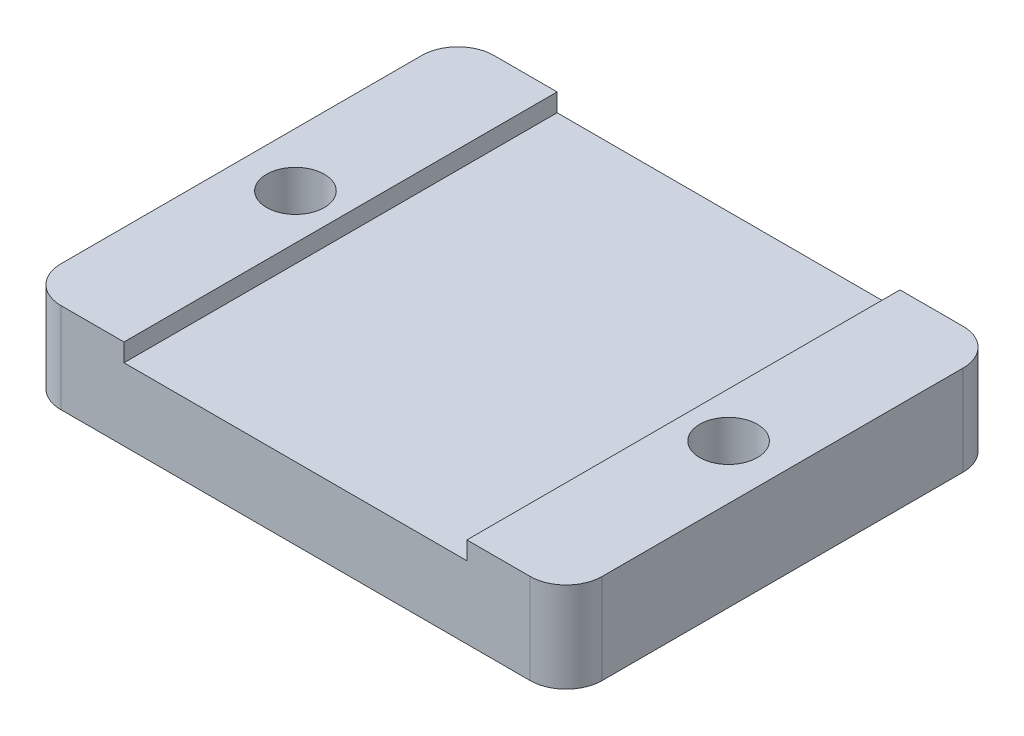
ISO-10303-21;
HEADER;
FILE_DESCRIPTION(('STEP AP214'),'2;1');
FILE_NAME('part.step','',(''),(''),'','','');
FILE_SCHEMA(('AUTOMOTIVE_DESIGN { 1 0 10303 214 1 1 1 1 }'));
ENDSEC;
DATA;
#1=APPLICATION_CONTEXT('core data for automotive mechanical design processes');
#2=APPLICATION_PROTOCOL_DEFINITION('international standard','automotive_design',2000,#1);
#3=PRODUCT_CONTEXT('',#1,'mechanical');
#4=PRODUCT('Part','Part','',(#3));
#5=PRODUCT_RELATED_PRODUCT_CATEGORY('part','',(#4));
#6=PRODUCT_DEFINITION_FORMATION('','',#4);
#7=PRODUCT_DEFINITION_CONTEXT('part definition',#1,'design');
#8=PRODUCT_DEFINITION('design','',#6,#7);
#9=PRODUCT_DEFINITION_SHAPE('','',#8);
#10=(LENGTH_UNIT() NAMED_UNIT(*) SI_UNIT(.MILLI.,.METRE.));
#11=(NAMED_UNIT(*) PLANE_ANGLE_UNIT() SI_UNIT($,.RADIAN.));
#12=(NAMED_UNIT(*) SI_UNIT($,.STERADIAN.) SOLID_ANGLE_UNIT());
#13=UNCERTAINTY_MEASURE_WITH_UNIT(LENGTH_MEASURE(1.E-05),#10,'distance_accuracy_value','');
#14=(GEOMETRIC_REPRESENTATION_CONTEXT(3) GLOBAL_UNCERTAINTY_ASSIGNED_CONTEXT((#13)) GLOBAL_UNIT_ASSIGNED_CONTEXT((#10,
#11,#12)) REPRESENTATION_CONTEXT('',''));
#15=CARTESIAN_POINT('',(0.,0.,0.));
#16=DIRECTION('',(0.,0.,1.));
#17=DIRECTION('',(1.,0.,0.));
#18=AXIS2_PLACEMENT_3D('',#15,#16,#17);
#19=CARTESIAN_POINT('',(0.,4.,0.));
#20=DIRECTION('',(0.,1.,0.));
#21=DIRECTION('',(0.,0.,1.));
#22=AXIS2_PLACEMENT_3D('',#19,#20,#21);
#23=PLANE('',#22);
#24=DIRECTION('',(1.,0.,0.));
#25=VECTOR('',#24,1.);
#26=CARTESIAN_POINT('',(-15.,4.,12.));
#27=LINE('',#26,#25);
#28=CARTESIAN_POINT('',(-9.5,4.,12.));
#29=VERTEX_POINT('',#28);
#30=CARTESIAN_POINT('',(9.5,4.,12.));
#31=VERTEX_POINT('',#30);
#32=EDGE_CURVE('E186',#29,#31,#27,.T.);
#33=ORIENTED_EDGE('',*,*,#32,.T.);
#34=DIRECTION('',(0.,0.,1.));
#35=VECTOR('',#34,1.);
#36=CARTESIAN_POINT('',(9.5,4.,0.));
#37=LINE('',#36,#35);
#38=CARTESIAN_POINT('',(9.5,4.,-12.));
#39=VERTEX_POINT('',#38);
#40=EDGE_CURVE('E294',#39,#31,#37,.T.);
#41=ORIENTED_EDGE('',*,*,#40,.F.);
#42=DIRECTION('',(-1.,0.,0.));
#43=VECTOR('',#42,1.);
#44=CARTESIAN_POINT('',(-15.,4.,-12.));
#45=LINE('',#44,#43);
#46=CARTESIAN_POINT('',(-9.5,4.,-12.));
#47=VERTEX_POINT('',#46);
#48=EDGE_CURVE('E153',#39,#47,#45,.T.);
#49=ORIENTED_EDGE('',*,*,#48,.T.);
#50=DIRECTION('',(0.,0.,1.));
#51=VECTOR('',#50,1.);
#52=CARTESIAN_POINT('',(-9.5,4.,0.));
#53=LINE('',#52,#51);
#54=EDGE_CURVE('E154',#47,#29,#53,.T.);
#55=ORIENTED_EDGE('',*,*,#54,.T.);
#56=EDGE_LOOP('',(#33,#41,#49,#55));
#57=FACE_BOUND('',#56,.T.);
#58=ADVANCED_FACE('F37',(#57),#23,.T.);
#59=CARTESIAN_POINT('',(0.,0.,0.));
#60=DIRECTION('',(0.,1.,0.));
#61=DIRECTION('',(0.,0.,1.));
#62=AXIS2_PLACEMENT_3D('',#59,#60,#61);
#63=PLANE('',#62);
#64=DIRECTION('',(-1.,0.,0.));
#65=VECTOR('',#64,1.);
#66=CARTESIAN_POINT('',(-15.,0.,-12.));
#67=LINE('',#66,#65);
#68=CARTESIAN_POINT('',(13.,0.,-12.));
#69=VERTEX_POINT('',#68);
#70=CARTESIAN_POINT('',(-13.,0.,-12.));
#71=VERTEX_POINT('',#70);
#72=EDGE_CURVE('E192',#69,#71,#67,.T.);
#73=ORIENTED_EDGE('',*,*,#72,.F.);
#74=CARTESIAN_POINT('',(13.,0.,-10.));
#75=DIRECTION('',(0.,1.,0.));
#76=DIRECTION('',(0.,0.,1.));
#77=AXIS2_PLACEMENT_3D('',#74,#75,#76);
#78=CIRCLE('',#77,2.);
#79=CARTESIAN_POINT('',(15.,0.,-10.));
#80=VERTEX_POINT('',#79);
#81=EDGE_CURVE('E208',#69,#80,#78,.F.);
#82=ORIENTED_EDGE('',*,*,#81,.T.);
#83=DIRECTION('',(0.,0.,-1.));
#84=VECTOR('',#83,1.);
#85=CARTESIAN_POINT('',(15.,0.,-12.));
#86=LINE('',#85,#84);
#87=CARTESIAN_POINT('',(15.,0.,10.));
#88=VERTEX_POINT('',#87);
#89=EDGE_CURVE('E184',#88,#80,#86,.T.);
#90=ORIENTED_EDGE('',*,*,#89,.F.);
#91=CARTESIAN_POINT('',(13.,0.,10.));
#92=DIRECTION('',(0.,1.,0.));
#93=DIRECTION('',(0.,0.,1.));
#94=AXIS2_PLACEMENT_3D('',#91,#92,#93);
#95=CIRCLE('',#94,2.);
#96=CARTESIAN_POINT('',(13.,0.,12.));
#97=VERTEX_POINT('',#96);
#98=EDGE_CURVE('E206',#88,#97,#95,.F.);
#99=ORIENTED_EDGE('',*,*,#98,.T.);
#100=DIRECTION('',(1.,0.,0.));
#101=VECTOR('',#100,1.);
#102=CARTESIAN_POINT('',(-15.,0.,12.));
#103=LINE('',#102,#101);
#104=CARTESIAN_POINT('',(-13.,0.,12.));
#105=VERTEX_POINT('',#104);
#106=EDGE_CURVE('E187',#105,#97,#103,.T.);
#107=ORIENTED_EDGE('',*,*,#106,.F.);
#108=CARTESIAN_POINT('',(-13.,0.,10.));
#109=DIRECTION('',(0.,1.,0.));
#110=DIRECTION('',(0.,0.,1.));
#111=AXIS2_PLACEMENT_3D('',#108,#109,#110);
#112=CIRCLE('',#111,2.);
#113=CARTESIAN_POINT('',(-15.,0.,10.));
#114=VERTEX_POINT('',#113);
#115=EDGE_CURVE('E204',#105,#114,#112,.F.);
#116=ORIENTED_EDGE('',*,*,#115,.T.);
#117=DIRECTION('',(0.,0.,1.));
#118=VECTOR('',#117,1.);
#119=CARTESIAN_POINT('',(-15.,0.,-12.));
#120=LINE('',#119,#118);
#121=CARTESIAN_POINT('',(-15.,0.,-10.));
#122=VERTEX_POINT('',#121);
#123=EDGE_CURVE('E195',#122,#114,#120,.T.);
#124=ORIENTED_EDGE('',*,*,#123,.F.);
#125=CARTESIAN_POINT('',(-13.,0.,-10.));
#126=DIRECTION('',(0.,1.,0.));
#127=DIRECTION('',(0.,0.,1.));
#128=AXIS2_PLACEMENT_3D('',#125,#126,#127);
#129=CIRCLE('',#128,2.);
#130=EDGE_CURVE('E202',#122,#71,#129,.F.);
#131=ORIENTED_EDGE('',*,*,#130,.T.);
#132=EDGE_LOOP('',(#73,#82,#90,#99,#107,#116,#124,#131));
#133=FACE_BOUND('',#132,.T.);
#134=CARTESIAN_POINT('',(-12.,0.,0.));
#135=DIRECTION('',(0.,1.,0.));
#136=DIRECTION('',(0.,0.,1.));
#137=AXIS2_PLACEMENT_3D('',#134,#135,#136);
#138=CIRCLE('',#137,1.6);
#139=CARTESIAN_POINT('',(-12.,0.,1.6));
#140=VERTEX_POINT('',#139);
#141=EDGE_CURVE('E181',#140,#140,#138,.T.);
#142=ORIENTED_EDGE('',*,*,#141,.T.);
#143=EDGE_LOOP('',(#142));
#144=FACE_BOUND('',#143,.T.);
#145=CARTESIAN_POINT('',(12.,0.,0.));
#146=DIRECTION('',(0.,1.,0.));
#147=DIRECTION('',(0.,0.,-1.));
#148=AXIS2_PLACEMENT_3D('',#145,#146,#147);
#149=CIRCLE('',#148,1.6);
#150=CARTESIAN_POINT('',(12.,0.,-1.6));
#151=VERTEX_POINT('',#150);
#152=EDGE_CURVE('E178',#151,#151,#149,.T.);
#153=ORIENTED_EDGE('',*,*,#152,.T.);
#154=EDGE_LOOP('',(#153));
#155=FACE_BOUND('',#154,.T.);
#156=ADVANCED_FACE('F232',(#133,#144,#155),#63,.F.);
#157=CARTESIAN_POINT('',(15.,4.,-12.));
#158=DIRECTION('',(-1.,0.,0.));
#159=DIRECTION('',(0.,0.,1.));
#160=AXIS2_PLACEMENT_3D('',#157,#158,#159);
#161=PLANE('',#160);
#162=ORIENTED_EDGE('',*,*,#89,.T.);
#163=DIRECTION('',(0.,-1.,0.));
#164=VECTOR('',#163,1.);
#165=CARTESIAN_POINT('',(15.,4.,-10.));
#166=LINE('',#165,#164);
#167=CARTESIAN_POINT('',(15.,5.,-10.));
#168=VERTEX_POINT('',#167);
#169=EDGE_CURVE('E213',#80,#168,#166,.F.);
#170=ORIENTED_EDGE('',*,*,#169,.T.);
#171=DIRECTION('',(0.,0.,-1.));
#172=VECTOR('',#171,1.);
#173=CARTESIAN_POINT('',(15.,5.,0.));
#174=LINE('',#173,#172);
#175=CARTESIAN_POINT('',(15.,5.,10.));
#176=VERTEX_POINT('',#175);
#177=EDGE_CURVE('E159',#176,#168,#174,.T.);
#178=ORIENTED_EDGE('',*,*,#177,.F.);
#179=DIRECTION('',(0.,-1.,0.));
#180=VECTOR('',#179,1.);
#181=CARTESIAN_POINT('',(15.,4.,10.));
#182=LINE('',#181,#180);
#183=EDGE_CURVE('E210',#176,#88,#182,.T.);
#184=ORIENTED_EDGE('',*,*,#183,.T.);
#185=EDGE_LOOP('',(#162,#170,#178,#184));
#186=FACE_BOUND('',#185,.T.);
#187=ADVANCED_FACE('F264',(#186),#161,.F.);
#188=CARTESIAN_POINT('',(-15.,4.,-12.));
#189=DIRECTION('',(0.,0.,1.));
#190=DIRECTION('',(1.,0.,0.));
#191=AXIS2_PLACEMENT_3D('',#188,#189,#190);
#192=PLANE('',#191);
#193=DIRECTION('',(-1.,0.,0.));
#194=VECTOR('',#193,1.);
#195=CARTESIAN_POINT('',(0.,5.,-12.));
#196=LINE('',#195,#194);
#197=CARTESIAN_POINT('',(13.,5.,-12.));
#198=VERTEX_POINT('',#197);
#199=CARTESIAN_POINT('',(9.5,5.,-12.));
#200=VERTEX_POINT('',#199);
#201=EDGE_CURVE('E125',#198,#200,#196,.T.);
#202=ORIENTED_EDGE('',*,*,#201,.F.);
#203=DIRECTION('',(0.,-1.,0.));
#204=VECTOR('',#203,1.);
#205=CARTESIAN_POINT('',(13.,4.,-12.));
#206=LINE('',#205,#204);
#207=EDGE_CURVE('E200',#198,#69,#206,.T.);
#208=ORIENTED_EDGE('',*,*,#207,.T.);
#209=ORIENTED_EDGE('',*,*,#72,.T.);
#210=DIRECTION('',(0.,-1.,0.));
#211=VECTOR('',#210,1.);
#212=CARTESIAN_POINT('',(-13.,4.,-12.));
#213=LINE('',#212,#211);
#214=CARTESIAN_POINT('',(-13.,5.,-12.));
#215=VERTEX_POINT('',#214);
#216=EDGE_CURVE('E189',#71,#215,#213,.F.);
#217=ORIENTED_EDGE('',*,*,#216,.T.);
#218=DIRECTION('',(-1.,0.,0.));
#219=VECTOR('',#218,1.);
#220=CARTESIAN_POINT('',(0.,5.,-12.));
#221=LINE('',#220,#219);
#222=CARTESIAN_POINT('',(-9.5,5.,-12.));
#223=VERTEX_POINT('',#222);
#224=EDGE_CURVE('E165',#223,#215,#221,.T.);
#225=ORIENTED_EDGE('',*,*,#224,.F.);
#226=DIRECTION('',(0.,-1.,0.));
#227=VECTOR('',#226,1.);
#228=CARTESIAN_POINT('',(-9.5,5.,-12.));
#229=LINE('',#228,#227);
#230=EDGE_CURVE('E176',#223,#47,#229,.T.);
#231=ORIENTED_EDGE('',*,*,#230,.T.);
#232=ORIENTED_EDGE('',*,*,#48,.F.);
#233=DIRECTION('',(0.,-1.,0.));
#234=VECTOR('',#233,1.);
#235=CARTESIAN_POINT('',(9.5,5.,-12.));
#236=LINE('',#235,#234);
#237=EDGE_CURVE('E144',#200,#39,#236,.T.);
#238=ORIENTED_EDGE('',*,*,#237,.F.);
#239=EDGE_LOOP('',(#202,#208,#209,#217,#225,#231,#232,#238));
#240=FACE_BOUND('',#239,.T.);
#241=ADVANCED_FACE('F151',(#240),#192,.F.);
#242=CARTESIAN_POINT('',(-15.,4.,-12.));
#243=DIRECTION('',(1.,0.,0.));
#244=DIRECTION('',(0.,0.,-1.));
#245=AXIS2_PLACEMENT_3D('',#242,#243,#244);
#246=PLANE('',#245);
#247=ORIENTED_EDGE('',*,*,#123,.T.);
#248=DIRECTION('',(0.,-1.,0.));
#249=VECTOR('',#248,1.);
#250=CARTESIAN_POINT('',(-15.,4.,10.));
#251=LINE('',#250,#249);
#252=CARTESIAN_POINT('',(-15.,5.,10.));
#253=VERTEX_POINT('',#252);
#254=EDGE_CURVE('E52',#114,#253,#251,.F.);
#255=ORIENTED_EDGE('',*,*,#254,.T.);
#256=DIRECTION('',(0.,0.,1.));
#257=VECTOR('',#256,1.);
#258=CARTESIAN_POINT('',(-15.,5.,0.));
#259=LINE('',#258,#257);
#260=CARTESIAN_POINT('',(-15.,5.,-10.));
#261=VERTEX_POINT('',#260);
#262=EDGE_CURVE('E167',#261,#253,#259,.T.);
#263=ORIENTED_EDGE('',*,*,#262,.F.);
#264=DIRECTION('',(0.,-1.,0.));
#265=VECTOR('',#264,1.);
#266=CARTESIAN_POINT('',(-15.,4.,-10.));
#267=LINE('',#266,#265);
#268=EDGE_CURVE('E223',#261,#122,#267,.T.);
#269=ORIENTED_EDGE('',*,*,#268,.T.);
#270=EDGE_LOOP('',(#247,#255,#263,#269));
#271=FACE_BOUND('',#270,.T.);
#272=ADVANCED_FACE('F228',(#271),#246,.F.);
#273=CARTESIAN_POINT('',(-15.,4.,12.));
#274=DIRECTION('',(0.,0.,-1.));
#275=DIRECTION('',(-1.,0.,0.));
#276=AXIS2_PLACEMENT_3D('',#273,#274,#275);
#277=PLANE('',#276);
#278=ORIENTED_EDGE('',*,*,#106,.T.);
#279=DIRECTION('',(0.,-1.,0.));
#280=VECTOR('',#279,1.);
#281=CARTESIAN_POINT('',(13.,4.,12.));
#282=LINE('',#281,#280);
#283=CARTESIAN_POINT('',(13.,5.,12.));
#284=VERTEX_POINT('',#283);
#285=EDGE_CURVE('E221',#97,#284,#282,.F.);
#286=ORIENTED_EDGE('',*,*,#285,.T.);
#287=DIRECTION('',(1.,0.,0.));
#288=VECTOR('',#287,1.);
#289=CARTESIAN_POINT('',(0.,5.,12.));
#290=LINE('',#289,#288);
#291=CARTESIAN_POINT('',(9.5,5.,12.));
#292=VERTEX_POINT('',#291);
#293=EDGE_CURVE('E148',#292,#284,#290,.T.);
#294=ORIENTED_EDGE('',*,*,#293,.F.);
#295=DIRECTION('',(0.,-1.,0.));
#296=VECTOR('',#295,1.);
#297=CARTESIAN_POINT('',(9.5,5.,12.));
#298=LINE('',#297,#296);
#299=EDGE_CURVE('E146',#292,#31,#298,.T.);
#300=ORIENTED_EDGE('',*,*,#299,.T.);
#301=ORIENTED_EDGE('',*,*,#32,.F.);
#302=DIRECTION('',(0.,-1.,0.));
#303=VECTOR('',#302,1.);
#304=CARTESIAN_POINT('',(-9.5,5.,12.));
#305=LINE('',#304,#303);
#306=CARTESIAN_POINT('',(-9.5,5.,12.));
#307=VERTEX_POINT('',#306);
#308=EDGE_CURVE('E173',#307,#29,#305,.T.);
#309=ORIENTED_EDGE('',*,*,#308,.F.);
#310=DIRECTION('',(1.,0.,0.));
#311=VECTOR('',#310,1.);
#312=CARTESIAN_POINT('',(0.,5.,12.));
#313=LINE('',#312,#311);
#314=CARTESIAN_POINT('',(-13.,5.,12.));
#315=VERTEX_POINT('',#314);
#316=EDGE_CURVE('E169',#315,#307,#313,.T.);
#317=ORIENTED_EDGE('',*,*,#316,.F.);
#318=DIRECTION('',(0.,-1.,0.));
#319=VECTOR('',#318,1.);
#320=CARTESIAN_POINT('',(-13.,4.,12.));
#321=LINE('',#320,#319);
#322=EDGE_CURVE('E218',#315,#105,#321,.T.);
#323=ORIENTED_EDGE('',*,*,#322,.T.);
#324=EDGE_LOOP('',(#278,#286,#294,#300,#301,#309,#317,#323));
#325=FACE_BOUND('',#324,.T.);
#326=ADVANCED_FACE('F241',(#325),#277,.F.);
#327=CARTESIAN_POINT('',(-12.,4.,0.));
#328=DIRECTION('',(0.,-1.,0.));
#329=DIRECTION('',(0.,0.,-1.));
#330=AXIS2_PLACEMENT_3D('',#327,#328,#329);
#331=CYLINDRICAL_SURFACE('',#330,1.6);
#332=ORIENTED_EDGE('',*,*,#141,.F.);
#333=EDGE_LOOP('',(#332));
#334=FACE_BOUND('',#333,.T.);
#335=CARTESIAN_POINT('',(-12.,5.,0.));
#336=DIRECTION('',(0.,1.,0.));
#337=DIRECTION('',(0.,0.,1.));
#338=AXIS2_PLACEMENT_3D('',#335,#336,#337);
#339=CIRCLE('',#338,1.6);
#340=CARTESIAN_POINT('',(-12.,5.,1.6));
#341=VERTEX_POINT('',#340);
#342=EDGE_CURVE('E171',#341,#341,#339,.F.);
#343=ORIENTED_EDGE('',*,*,#342,.F.);
#344=EDGE_LOOP('',(#343));
#345=FACE_BOUND('',#344,.T.);
#346=ADVANCED_FACE('F267',(#334,#345),#331,.F.);
#347=CARTESIAN_POINT('',(12.,4.,0.));
#348=DIRECTION('',(0.,-1.,0.));
#349=DIRECTION('',(0.,0.,-1.));
#350=AXIS2_PLACEMENT_3D('',#347,#348,#349);
#351=CYLINDRICAL_SURFACE('',#350,1.6);
#352=ORIENTED_EDGE('',*,*,#152,.F.);
#353=EDGE_LOOP('',(#352));
#354=FACE_BOUND('',#353,.T.);
#355=CARTESIAN_POINT('',(12.,5.,0.));
#356=DIRECTION('',(0.,1.,0.));
#357=DIRECTION('',(0.,0.,1.));
#358=AXIS2_PLACEMENT_3D('',#355,#356,#357);
#359=CIRCLE('',#358,1.6);
#360=CARTESIAN_POINT('',(12.,5.,1.6));
#361=VERTEX_POINT('',#360);
#362=EDGE_CURVE('E138',#361,#361,#359,.F.);
#363=ORIENTED_EDGE('',*,*,#362,.F.);
#364=EDGE_LOOP('',(#363));
#365=FACE_BOUND('',#364,.T.);
#366=ADVANCED_FACE('F300',(#354,#365),#351,.F.);
#367=CARTESIAN_POINT('',(-9.5,5.,0.));
#368=DIRECTION('',(1.,0.,0.));
#369=DIRECTION('',(0.,0.,-1.));
#370=AXIS2_PLACEMENT_3D('',#367,#368,#369);
#371=PLANE('',#370);
#372=ORIENTED_EDGE('',*,*,#54,.F.);
#373=ORIENTED_EDGE('',*,*,#230,.F.);
#374=DIRECTION('',(0.,0.,1.));
#375=VECTOR('',#374,1.);
#376=CARTESIAN_POINT('',(-9.5,5.,0.));
#377=LINE('',#376,#375);
#378=EDGE_CURVE('E157',#223,#307,#377,.T.);
#379=ORIENTED_EDGE('',*,*,#378,.T.);
#380=ORIENTED_EDGE('',*,*,#308,.T.);
#381=EDGE_LOOP('',(#372,#373,#379,#380));
#382=FACE_BOUND('',#381,.T.);
#383=ADVANCED_FACE('F251',(#382),#371,.T.);
#384=CARTESIAN_POINT('',(0.,5.,0.));
#385=DIRECTION('',(0.,1.,0.));
#386=DIRECTION('',(0.,0.,1.));
#387=AXIS2_PLACEMENT_3D('',#384,#385,#386);
#388=PLANE('',#387);
#389=ORIENTED_EDGE('',*,*,#262,.T.);
#390=CARTESIAN_POINT('',(-13.,5.,10.));
#391=DIRECTION('',(0.,1.,0.));
#392=DIRECTION('',(0.,0.,1.));
#393=AXIS2_PLACEMENT_3D('',#390,#391,#392);
#394=CIRCLE('',#393,2.);
#395=EDGE_CURVE('E11',#253,#315,#394,.T.);
#396=ORIENTED_EDGE('',*,*,#395,.T.);
#397=ORIENTED_EDGE('',*,*,#316,.T.);
#398=ORIENTED_EDGE('',*,*,#378,.F.);
#399=ORIENTED_EDGE('',*,*,#224,.T.);
#400=CARTESIAN_POINT('',(-13.,5.,-10.));
#401=DIRECTION('',(0.,1.,0.));
#402=DIRECTION('',(0.,0.,1.));
#403=AXIS2_PLACEMENT_3D('',#400,#401,#402);
#404=CIRCLE('',#403,2.);
#405=EDGE_CURVE('E45',#215,#261,#404,.T.);
#406=ORIENTED_EDGE('',*,*,#405,.T.);
#407=EDGE_LOOP('',(#389,#396,#397,#398,#399,#406));
#408=FACE_BOUND('',#407,.T.);
#409=ORIENTED_EDGE('',*,*,#342,.T.);
#410=EDGE_LOOP('',(#409));
#411=FACE_BOUND('',#410,.T.);
#412=ADVANCED_FACE('F246',(#408,#411),#388,.T.);
#413=CARTESIAN_POINT('',(9.5,5.,0.));
#414=DIRECTION('',(1.,0.,0.));
#415=DIRECTION('',(0.,0.,-1.));
#416=AXIS2_PLACEMENT_3D('',#413,#414,#415);
#417=PLANE('',#416);
#418=ORIENTED_EDGE('',*,*,#40,.T.);
#419=ORIENTED_EDGE('',*,*,#299,.F.);
#420=DIRECTION('',(0.,0.,1.));
#421=VECTOR('',#420,1.);
#422=CARTESIAN_POINT('',(9.5,5.,0.));
#423=LINE('',#422,#421);
#424=EDGE_CURVE('E130',#200,#292,#423,.T.);
#425=ORIENTED_EDGE('',*,*,#424,.F.);
#426=ORIENTED_EDGE('',*,*,#237,.T.);
#427=EDGE_LOOP('',(#418,#419,#425,#426));
#428=FACE_BOUND('',#427,.T.);
#429=ADVANCED_FACE('F143',(#428),#417,.F.);
#430=CARTESIAN_POINT('',(0.,5.,0.));
#431=DIRECTION('',(0.,1.,0.));
#432=DIRECTION('',(0.,0.,1.));
#433=AXIS2_PLACEMENT_3D('',#430,#431,#432);
#434=PLANE('',#433);
#435=ORIENTED_EDGE('',*,*,#362,.T.);
#436=EDGE_LOOP('',(#435));
#437=FACE_BOUND('',#436,.T.);
#438=ORIENTED_EDGE('',*,*,#177,.T.);
#439=CARTESIAN_POINT('',(13.,5.,-10.));
#440=DIRECTION('',(0.,1.,0.));
#441=DIRECTION('',(0.,0.,1.));
#442=AXIS2_PLACEMENT_3D('',#439,#440,#441);
#443=CIRCLE('',#442,2.);
#444=EDGE_CURVE('E133',#168,#198,#443,.T.);
#445=ORIENTED_EDGE('',*,*,#444,.T.);
#446=ORIENTED_EDGE('',*,*,#201,.T.);
#447=ORIENTED_EDGE('',*,*,#424,.T.);
#448=ORIENTED_EDGE('',*,*,#293,.T.);
#449=CARTESIAN_POINT('',(13.,5.,10.));
#450=DIRECTION('',(0.,1.,0.));
#451=DIRECTION('',(0.,0.,1.));
#452=AXIS2_PLACEMENT_3D('',#449,#450,#451);
#453=CIRCLE('',#452,2.);
#454=EDGE_CURVE('E215',#284,#176,#453,.T.);
#455=ORIENTED_EDGE('',*,*,#454,.T.);
#456=EDGE_LOOP('',(#438,#445,#446,#447,#448,#455));
#457=FACE_BOUND('',#456,.T.);
#458=ADVANCED_FACE('F128',(#437,#457),#434,.T.);
#459=CARTESIAN_POINT('',(13.,4.,-10.));
#460=DIRECTION('',(0.,-1.,0.));
#461=DIRECTION('',(0.,0.,-1.));
#462=AXIS2_PLACEMENT_3D('',#459,#460,#461);
#463=CYLINDRICAL_SURFACE('',#462,2.);
#464=ORIENTED_EDGE('',*,*,#444,.F.);
#465=ORIENTED_EDGE('',*,*,#169,.F.);
#466=ORIENTED_EDGE('',*,*,#81,.F.);
#467=ORIENTED_EDGE('',*,*,#207,.F.);
#468=EDGE_LOOP('',(#464,#465,#466,#467));
#469=FACE_BOUND('',#468,.T.);
#470=ADVANCED_FACE('F279',(#469),#463,.T.);
#471=CARTESIAN_POINT('',(13.,4.,10.));
#472=DIRECTION('',(0.,-1.,0.));
#473=DIRECTION('',(0.,0.,-1.));
#474=AXIS2_PLACEMENT_3D('',#471,#472,#473);
#475=CYLINDRICAL_SURFACE('',#474,2.);
#476=ORIENTED_EDGE('',*,*,#454,.F.);
#477=ORIENTED_EDGE('',*,*,#285,.F.);
#478=ORIENTED_EDGE('',*,*,#98,.F.);
#479=ORIENTED_EDGE('',*,*,#183,.F.);
#480=EDGE_LOOP('',(#476,#477,#478,#479));
#481=FACE_BOUND('',#480,.T.);
#482=ADVANCED_FACE('F257',(#481),#475,.T.);
#483=CARTESIAN_POINT('',(-13.,4.,10.));
#484=DIRECTION('',(0.,-1.,0.));
#485=DIRECTION('',(0.,0.,-1.));
#486=AXIS2_PLACEMENT_3D('',#483,#484,#485);
#487=CYLINDRICAL_SURFACE('',#486,2.);
#488=ORIENTED_EDGE('',*,*,#395,.F.);
#489=ORIENTED_EDGE('',*,*,#254,.F.);
#490=ORIENTED_EDGE('',*,*,#115,.F.);
#491=ORIENTED_EDGE('',*,*,#322,.F.);
#492=EDGE_LOOP('',(#488,#489,#490,#491));
#493=FACE_BOUND('',#492,.T.);
#494=ADVANCED_FACE('F238',(#493),#487,.T.);
#495=CARTESIAN_POINT('',(-13.,4.,-10.));
#496=DIRECTION('',(0.,-1.,0.));
#497=DIRECTION('',(0.,0.,-1.));
#498=AXIS2_PLACEMENT_3D('',#495,#496,#497);
#499=CYLINDRICAL_SURFACE('',#498,2.);
#500=ORIENTED_EDGE('',*,*,#405,.F.);
#501=ORIENTED_EDGE('',*,*,#216,.F.);
#502=ORIENTED_EDGE('',*,*,#130,.F.);
#503=ORIENTED_EDGE('',*,*,#268,.F.);
#504=EDGE_LOOP('',(#500,#501,#502,#503));
#505=FACE_BOUND('',#504,.T.);
#506=ADVANCED_FACE('F39',(#505),#499,.T.);
#507=CLOSED_SHELL('',(#58,#156,#187,#241,#272,#326,#346,#366,#383,#412,#429,#458,#470,#482,#494,#506));
#508=MANIFOLD_SOLID_BREP('B2',#507);
#509=ADVANCED_BREP_SHAPE_REPRESENTATION('',(#18,#508),#14);
#510=SHAPE_DEFINITION_REPRESENTATION(#9,#509);
ENDSEC;
END-ISO-10303-21;
